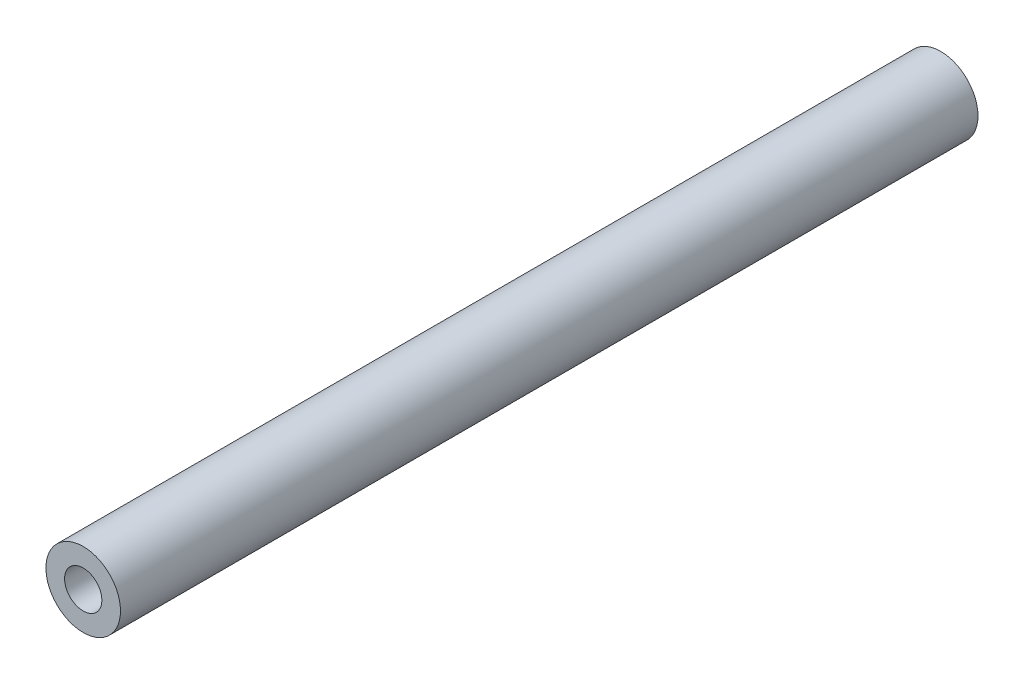
ISO-10303-21;
HEADER;
FILE_DESCRIPTION(('STEP AP214'),'2;1');
FILE_NAME('part.step','',(''),(''),'','','');
FILE_SCHEMA(('AUTOMOTIVE_DESIGN { 1 0 10303 214 1 1 1 1 }'));
ENDSEC;
DATA;
#1=APPLICATION_CONTEXT('core data for automotive mechanical design processes');
#2=APPLICATION_PROTOCOL_DEFINITION('international standard','automotive_design',2000,#1);
#3=PRODUCT_CONTEXT('',#1,'mechanical');
#4=PRODUCT('Part','Part','',(#3));
#5=PRODUCT_RELATED_PRODUCT_CATEGORY('part','',(#4));
#6=PRODUCT_DEFINITION_FORMATION('','',#4);
#7=PRODUCT_DEFINITION_CONTEXT('part definition',#1,'design');
#8=PRODUCT_DEFINITION('design','',#6,#7);
#9=PRODUCT_DEFINITION_SHAPE('','',#8);
#10=(LENGTH_UNIT() NAMED_UNIT(*) SI_UNIT(.MILLI.,.METRE.));
#11=(NAMED_UNIT(*) PLANE_ANGLE_UNIT() SI_UNIT($,.RADIAN.));
#12=(NAMED_UNIT(*) SI_UNIT($,.STERADIAN.) SOLID_ANGLE_UNIT());
#13=UNCERTAINTY_MEASURE_WITH_UNIT(LENGTH_MEASURE(1.E-05),#10,'distance_accuracy_value','');
#14=(GEOMETRIC_REPRESENTATION_CONTEXT(3) GLOBAL_UNCERTAINTY_ASSIGNED_CONTEXT((#13)) GLOBAL_UNIT_ASSIGNED_CONTEXT((#10,
#11,#12)) REPRESENTATION_CONTEXT('',''));
#15=CARTESIAN_POINT('',(0.,0.,0.));
#16=DIRECTION('',(0.,0.,1.));
#17=DIRECTION('',(1.,0.,0.));
#18=AXIS2_PLACEMENT_3D('',#15,#16,#17);
#19=CARTESIAN_POINT('',(0.,0.,46.));
#20=DIRECTION('',(0.,0.,1.));
#21=DIRECTION('',(1.,0.,0.));
#22=AXIS2_PLACEMENT_3D('',#19,#20,#21);
#23=PLANE('',#22);
#24=CARTESIAN_POINT('',(0.,0.,46.));
#25=DIRECTION('',(0.,0.,1.));
#26=DIRECTION('',(1.,0.,0.));
#27=AXIS2_PLACEMENT_3D('',#24,#25,#26);
#28=CIRCLE('',#27,2.);
#29=CARTESIAN_POINT('',(2.,0.,46.));
#30=VERTEX_POINT('',#29);
#31=EDGE_CURVE('E10',#30,#30,#28,.T.);
#32=ORIENTED_EDGE('',*,*,#31,.T.);
#33=EDGE_LOOP('',(#32));
#34=FACE_BOUND('',#33,.T.);
#35=CARTESIAN_POINT('',(0.,0.,46.));
#36=DIRECTION('',(0.,0.,1.));
#37=DIRECTION('',(1.,0.,0.));
#38=AXIS2_PLACEMENT_3D('',#35,#36,#37);
#39=CIRCLE('',#38,1.);
#40=CARTESIAN_POINT('',(1.,0.,46.));
#41=VERTEX_POINT('',#40);
#42=EDGE_CURVE('E47',#41,#41,#39,.T.);
#43=ORIENTED_EDGE('',*,*,#42,.F.);
#44=EDGE_LOOP('',(#43));
#45=FACE_BOUND('',#44,.T.);
#46=ADVANCED_FACE('F35',(#34,#45),#23,.T.);
#47=CARTESIAN_POINT('',(0.,0.,0.));
#48=DIRECTION('',(0.,0.,1.));
#49=DIRECTION('',(1.,0.,0.));
#50=AXIS2_PLACEMENT_3D('',#47,#48,#49);
#51=PLANE('',#50);
#52=CARTESIAN_POINT('',(0.,0.,0.));
#53=DIRECTION('',(0.,0.,1.));
#54=DIRECTION('',(1.,0.,0.));
#55=AXIS2_PLACEMENT_3D('',#52,#53,#54);
#56=CIRCLE('',#55,2.);
#57=CARTESIAN_POINT('',(2.,0.,0.));
#58=VERTEX_POINT('',#57);
#59=EDGE_CURVE('E39',#58,#58,#56,.T.);
#60=ORIENTED_EDGE('',*,*,#59,.F.);
#61=EDGE_LOOP('',(#60));
#62=FACE_BOUND('',#61,.T.);
#63=CARTESIAN_POINT('',(0.,0.,0.));
#64=DIRECTION('',(0.,0.,1.));
#65=DIRECTION('',(1.,0.,0.));
#66=AXIS2_PLACEMENT_3D('',#63,#64,#65);
#67=CIRCLE('',#66,1.);
#68=CARTESIAN_POINT('',(1.,0.,0.));
#69=VERTEX_POINT('',#68);
#70=EDGE_CURVE('E49',#69,#69,#67,.T.);
#71=ORIENTED_EDGE('',*,*,#70,.T.);
#72=EDGE_LOOP('',(#71));
#73=FACE_BOUND('',#72,.T.);
#74=ADVANCED_FACE('F60',(#62,#73),#51,.F.);
#75=CARTESIAN_POINT('',(0.,0.,46.));
#76=DIRECTION('',(0.,0.,-1.));
#77=DIRECTION('',(-1.,0.,0.));
#78=AXIS2_PLACEMENT_3D('',#75,#76,#77);
#79=CYLINDRICAL_SURFACE('',#78,2.);
#80=ORIENTED_EDGE('',*,*,#31,.F.);
#81=EDGE_LOOP('',(#80));
#82=FACE_BOUND('',#81,.T.);
#83=ORIENTED_EDGE('',*,*,#59,.T.);
#84=EDGE_LOOP('',(#83));
#85=FACE_BOUND('',#84,.T.);
#86=ADVANCED_FACE('F37',(#82,#85),#79,.T.);
#87=CARTESIAN_POINT('',(0.,0.,46.));
#88=DIRECTION('',(0.,0.,-1.));
#89=DIRECTION('',(-1.,0.,0.));
#90=AXIS2_PLACEMENT_3D('',#87,#88,#89);
#91=CYLINDRICAL_SURFACE('',#90,1.);
#92=ORIENTED_EDGE('',*,*,#42,.T.);
#93=EDGE_LOOP('',(#92));
#94=FACE_BOUND('',#93,.T.);
#95=ORIENTED_EDGE('',*,*,#70,.F.);
#96=EDGE_LOOP('',(#95));
#97=FACE_BOUND('',#96,.T.);
#98=ADVANCED_FACE('F56',(#94,#97),#91,.F.);
#99=CLOSED_SHELL('',(#46,#74,#86,#98));
#100=MANIFOLD_SOLID_BREP('B2',#99);
#101=ADVANCED_BREP_SHAPE_REPRESENTATION('',(#18,#100),#14);
#102=SHAPE_DEFINITION_REPRESENTATION(#9,#101);
ENDSEC;
END-ISO-10303-21;
